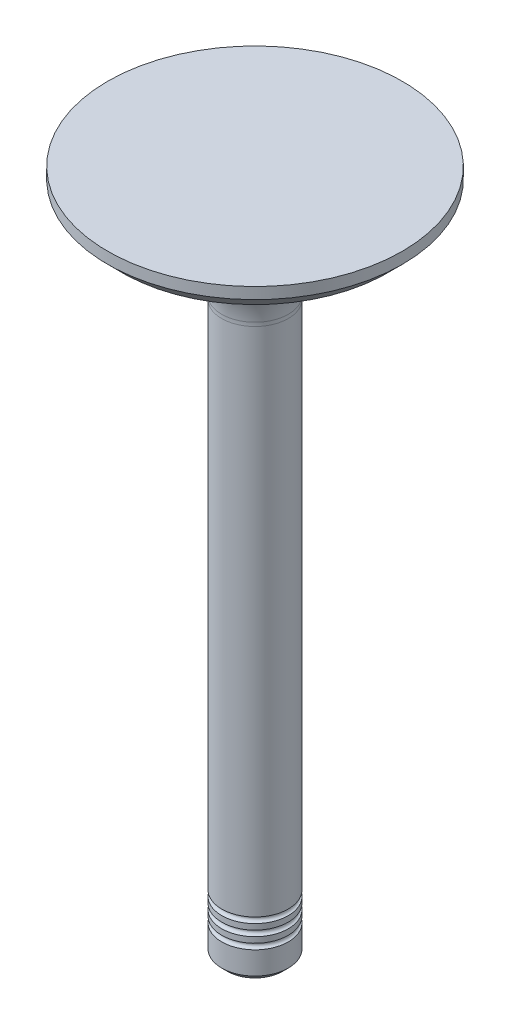
ISO-10303-21;
HEADER;
FILE_DESCRIPTION(('STEP AP214'),'2;1');
FILE_NAME('part.step','',(''),(''),'','','');
FILE_SCHEMA(('AUTOMOTIVE_DESIGN { 1 0 10303 214 1 1 1 1 }'));
ENDSEC;
DATA;
#1=APPLICATION_CONTEXT('core data for automotive mechanical design processes');
#2=APPLICATION_PROTOCOL_DEFINITION('international standard','automotive_design',2000,#1);
#3=PRODUCT_CONTEXT('',#1,'mechanical');
#4=PRODUCT('Part','Part','',(#3));
#5=PRODUCT_RELATED_PRODUCT_CATEGORY('part','',(#4));
#6=PRODUCT_DEFINITION_FORMATION('','',#4);
#7=PRODUCT_DEFINITION_CONTEXT('part definition',#1,'design');
#8=PRODUCT_DEFINITION('design','',#6,#7);
#9=PRODUCT_DEFINITION_SHAPE('','',#8);
#10=(LENGTH_UNIT() NAMED_UNIT(*) SI_UNIT(.MILLI.,.METRE.));
#11=(NAMED_UNIT(*) PLANE_ANGLE_UNIT() SI_UNIT($,.RADIAN.));
#12=(NAMED_UNIT(*) SI_UNIT($,.STERADIAN.) SOLID_ANGLE_UNIT());
#13=UNCERTAINTY_MEASURE_WITH_UNIT(LENGTH_MEASURE(1.E-05),#10,'distance_accuracy_value','');
#14=(GEOMETRIC_REPRESENTATION_CONTEXT(3) GLOBAL_UNCERTAINTY_ASSIGNED_CONTEXT((#13)) GLOBAL_UNIT_ASSIGNED_CONTEXT((#10,
#11,#12)) REPRESENTATION_CONTEXT('',''));
#15=CARTESIAN_POINT('',(0.,0.,0.));
#16=DIRECTION('',(0.,0.,1.));
#17=DIRECTION('',(1.,0.,0.));
#18=AXIS2_PLACEMENT_3D('',#15,#16,#17);
#19=CARTESIAN_POINT('',(0.,224.082988103468,0.));
#20=DIRECTION('',(0.,1.,0.));
#21=DIRECTION('',(-1.,0.,0.));
#22=AXIS2_PLACEMENT_3D('',#19,#20,#21);
#23=CYLINDRICAL_SURFACE('',#22,5.85);
#24=CARTESIAN_POINT('',(0.,113.822988103468,3.90445199648833E-13));
#25=DIRECTION('',(0.,1.,0.));
#26=DIRECTION('',(0.,0.,1.));
#27=AXIS2_PLACEMENT_3D('',#24,#25,#26);
#28=CIRCLE('',#27,5.84999999999962);
#29=CARTESIAN_POINT('',(0.,113.822988103468,5.85000000000001));
#30=VERTEX_POINT('',#29);
#31=EDGE_CURVE('E83',#30,#30,#28,.T.);
#32=ORIENTED_EDGE('',*,*,#31,.T.);
#33=EDGE_LOOP('',(#32));
#34=FACE_BOUND('',#33,.T.);
#35=CARTESIAN_POINT('',(0.,203.798278694884,0.));
#36=DIRECTION('',(0.,1.,0.));
#37=DIRECTION('',(-1.,0.,0.));
#38=AXIS2_PLACEMENT_3D('',#35,#36,#37);
#39=CIRCLE('',#38,5.85);
#40=CARTESIAN_POINT('',(-5.85,203.798278694884,0.));
#41=VERTEX_POINT('',#40);
#42=EDGE_CURVE('E59',#41,#41,#39,.F.);
#43=ORIENTED_EDGE('',*,*,#42,.T.);
#44=EDGE_LOOP('',(#43));
#45=FACE_BOUND('',#44,.T.);
#46=ADVANCED_FACE('F45',(#34,#45),#23,.T.);
#47=CARTESIAN_POINT('',(0.,203.387704382978,0.));
#48=DIRECTION('',(0.,1.,0.));
#49=DIRECTION('',(-1.,0.,0.));
#50=AXIS2_PLACEMENT_3D('',#47,#48,#49);
#51=TOROIDAL_SURFACE('',#50,21.9946855519471,16.1583871101048);
#52=CARTESIAN_POINT('',(0.,204.464969996624,0.));
#53=DIRECTION('',(0.,-1.,0.));
#54=DIRECTION('',(1.,0.,0.));
#55=AXIS2_PLACEMENT_3D('',#52,#53,#54);
#56=CIRCLE('',#55,5.87224861463346);
#57=CARTESIAN_POINT('',(5.87224861463347,204.464969996624,0.));
#58=VERTEX_POINT('',#57);
#59=EDGE_CURVE('E64',#58,#58,#56,.F.);
#60=ORIENTED_EDGE('',*,*,#59,.T.);
#61=EDGE_LOOP('',(#60));
#62=FACE_BOUND('',#61,.T.);
#63=CARTESIAN_POINT('',(0.,219.490988103468,0.));
#64=DIRECTION('',(0.,1.,0.));
#65=DIRECTION('',(-1.,0.,0.));
#66=AXIS2_PLACEMENT_3D('',#63,#64,#65);
#67=CIRCLE('',#66,23.328);
#68=CARTESIAN_POINT('',(-23.328,219.490988103468,0.));
#69=VERTEX_POINT('',#68);
#70=EDGE_CURVE('E70',#69,#69,#67,.T.);
#71=ORIENTED_EDGE('',*,*,#70,.F.);
#72=EDGE_LOOP('',(#71));
#73=FACE_BOUND('',#72,.T.);
#74=ADVANCED_FACE('F126',(#62,#73),#51,.F.);
#75=CARTESIAN_POINT('',(0.,222.082988103468,0.));
#76=DIRECTION('',(0.,1.,0.));
#77=DIRECTION('',(-1.,0.,0.));
#78=AXIS2_PLACEMENT_3D('',#75,#76,#77);
#79=CONICAL_SURFACE('',#78,25.92,0.785398163397452);
#80=ORIENTED_EDGE('',*,*,#70,.T.);
#81=EDGE_LOOP('',(#80));
#82=FACE_BOUND('',#81,.T.);
#83=CARTESIAN_POINT('',(0.,222.082988103468,0.));
#84=DIRECTION('',(0.,1.,0.));
#85=DIRECTION('',(-1.,0.,0.));
#86=AXIS2_PLACEMENT_3D('',#83,#84,#85);
#87=CIRCLE('',#86,25.92);
#88=CARTESIAN_POINT('',(-25.92,222.082988103468,0.));
#89=VERTEX_POINT('',#88);
#90=EDGE_CURVE('E74',#89,#89,#87,.T.);
#91=ORIENTED_EDGE('',*,*,#90,.F.);
#92=EDGE_LOOP('',(#91));
#93=FACE_BOUND('',#92,.T.);
#94=ADVANCED_FACE('F132',(#82,#93),#79,.T.);
#95=CARTESIAN_POINT('',(0.,224.082988103468,0.));
#96=DIRECTION('',(0.,1.,0.));
#97=DIRECTION('',(-1.,0.,0.));
#98=AXIS2_PLACEMENT_3D('',#95,#96,#97);
#99=CYLINDRICAL_SURFACE('',#98,25.92);
#100=ORIENTED_EDGE('',*,*,#90,.T.);
#101=EDGE_LOOP('',(#100));
#102=FACE_BOUND('',#101,.T.);
#103=CARTESIAN_POINT('',(0.,224.082988103468,0.));
#104=DIRECTION('',(0.,1.,0.));
#105=DIRECTION('',(-1.,0.,0.));
#106=AXIS2_PLACEMENT_3D('',#103,#104,#105);
#107=CIRCLE('',#106,25.92);
#108=CARTESIAN_POINT('',(-25.92,224.082988103468,0.));
#109=VERTEX_POINT('',#108);
#110=EDGE_CURVE('E78',#109,#109,#107,.T.);
#111=ORIENTED_EDGE('',*,*,#110,.F.);
#112=EDGE_LOOP('',(#111));
#113=FACE_BOUND('',#112,.T.);
#114=ADVANCED_FACE('F163',(#102,#113),#99,.T.);
#115=CARTESIAN_POINT('',(0.,224.082988103468,0.));
#116=DIRECTION('',(0.,1.,0.));
#117=DIRECTION('',(-1.,0.,0.));
#118=AXIS2_PLACEMENT_3D('',#115,#116,#117);
#119=PLANE('',#118);
#120=ORIENTED_EDGE('',*,*,#110,.T.);
#121=EDGE_LOOP('',(#120));
#122=FACE_BOUND('',#121,.T.);
#123=ADVANCED_FACE('F156',(#122),#119,.T.);
#124=CARTESIAN_POINT('',(0.,203.798278694884,0.));
#125=DIRECTION('',(0.,1.,0.));
#126=DIRECTION('',(-1.,0.,0.));
#127=AXIS2_PLACEMENT_3D('',#124,#125,#126);
#128=TOROIDAL_SURFACE('',#127,15.85,10.);
#129=ORIENTED_EDGE('',*,*,#42,.F.);
#130=EDGE_LOOP('',(#129));
#131=FACE_BOUND('',#130,.T.);
#132=ORIENTED_EDGE('',*,*,#59,.F.);
#133=EDGE_LOOP('',(#132));
#134=FACE_BOUND('',#133,.T.);
#135=ADVANCED_FACE('F143',(#131,#134),#128,.F.);
#136=CARTESIAN_POINT('',(0.,113.322988103468,3.88578058618805E-13));
#137=DIRECTION('',(0.,1.,0.));
#138=DIRECTION('',(0.,0.,1.));
#139=AXIS2_PLACEMENT_3D('',#136,#137,#138);
#140=TOROIDAL_SURFACE('',#139,5.84999999999962,0.5);
#141=ORIENTED_EDGE('',*,*,#31,.F.);
#142=EDGE_LOOP('',(#141));
#143=FACE_BOUND('',#142,.T.);
#144=CARTESIAN_POINT('',(0.,112.822988103468,3.87014505243645E-13));
#145=DIRECTION('',(0.,1.,0.));
#146=DIRECTION('',(0.,0.,1.));
#147=AXIS2_PLACEMENT_3D('',#144,#145,#146);
#148=CIRCLE('',#147,5.84999999999962);
#149=CARTESIAN_POINT('',(0.,112.822988103468,5.85000000000001));
#150=VERTEX_POINT('',#149);
#151=EDGE_CURVE('E88',#150,#150,#148,.T.);
#152=ORIENTED_EDGE('',*,*,#151,.T.);
#153=EDGE_LOOP('',(#152));
#154=FACE_BOUND('',#153,.T.);
#155=ADVANCED_FACE('F136',(#143,#154),#140,.F.);
#156=CARTESIAN_POINT('',(0.,111.822988103468,3.83583810838456E-13));
#157=DIRECTION('',(0.,1.,0.));
#158=DIRECTION('',(0.,0.,1.));
#159=AXIS2_PLACEMENT_3D('',#156,#157,#158);
#160=CIRCLE('',#159,5.84999999999962);
#161=CARTESIAN_POINT('',(0.,111.822988103468,5.85));
#162=VERTEX_POINT('',#161);
#163=EDGE_CURVE('E92',#162,#162,#160,.T.);
#164=ORIENTED_EDGE('',*,*,#163,.T.);
#165=EDGE_LOOP('',(#164));
#166=FACE_BOUND('',#165,.T.);
#167=ORIENTED_EDGE('',*,*,#151,.F.);
#168=EDGE_LOOP('',(#167));
#169=FACE_BOUND('',#168,.T.);
#170=ADVANCED_FACE('F124',(#166,#169),#23,.T.);
#171=CARTESIAN_POINT('',(0.,111.322988103468,3.81639164714898E-13));
#172=DIRECTION('',(0.,1.,0.));
#173=DIRECTION('',(0.,0.,1.));
#174=AXIS2_PLACEMENT_3D('',#171,#172,#173);
#175=TOROIDAL_SURFACE('',#174,5.84999999999962,0.5);
#176=ORIENTED_EDGE('',*,*,#163,.F.);
#177=EDGE_LOOP('',(#176));
#178=FACE_BOUND('',#177,.T.);
#179=CARTESIAN_POINT('',(0.,110.822988103468,3.80153116433268E-13));
#180=DIRECTION('',(0.,1.,0.));
#181=DIRECTION('',(0.,0.,1.));
#182=AXIS2_PLACEMENT_3D('',#179,#180,#181);
#183=CIRCLE('',#182,5.84999999999962);
#184=CARTESIAN_POINT('',(0.,110.822988103468,5.85));
#185=VERTEX_POINT('',#184);
#186=EDGE_CURVE('E87',#185,#185,#183,.T.);
#187=ORIENTED_EDGE('',*,*,#186,.T.);
#188=EDGE_LOOP('',(#187));
#189=FACE_BOUND('',#188,.T.);
#190=ADVANCED_FACE('F122',(#178,#189),#175,.F.);
#191=CARTESIAN_POINT('',(0.,109.822988103468,3.76722422028079E-13));
#192=DIRECTION('',(0.,1.,0.));
#193=DIRECTION('',(0.,0.,1.));
#194=AXIS2_PLACEMENT_3D('',#191,#192,#193);
#195=CIRCLE('',#194,5.84999999999962);
#196=CARTESIAN_POINT('',(0.,109.822988103468,5.85));
#197=VERTEX_POINT('',#196);
#198=EDGE_CURVE('E82',#197,#197,#195,.T.);
#199=ORIENTED_EDGE('',*,*,#198,.T.);
#200=EDGE_LOOP('',(#199));
#201=FACE_BOUND('',#200,.T.);
#202=ORIENTED_EDGE('',*,*,#186,.F.);
#203=EDGE_LOOP('',(#202));
#204=FACE_BOUND('',#203,.T.);
#205=ADVANCED_FACE('F112',(#201,#204),#23,.T.);
#206=CARTESIAN_POINT('',(0.,109.322988103468,3.7470027081099E-13));
#207=DIRECTION('',(0.,1.,0.));
#208=DIRECTION('',(0.,0.,1.));
#209=AXIS2_PLACEMENT_3D('',#206,#207,#208);
#210=TOROIDAL_SURFACE('',#209,5.84999999999962,0.5);
#211=ORIENTED_EDGE('',*,*,#198,.F.);
#212=EDGE_LOOP('',(#211));
#213=FACE_BOUND('',#212,.T.);
#214=CARTESIAN_POINT('',(0.,108.822988103468,3.73291727622891E-13));
#215=DIRECTION('',(0.,1.,0.));
#216=DIRECTION('',(0.,0.,1.));
#217=AXIS2_PLACEMENT_3D('',#214,#215,#216);
#218=CIRCLE('',#217,5.84999999999962);
#219=CARTESIAN_POINT('',(0.,108.822988103468,5.85));
#220=VERTEX_POINT('',#219);
#221=EDGE_CURVE('E96',#220,#220,#218,.T.);
#222=ORIENTED_EDGE('',*,*,#221,.T.);
#223=EDGE_LOOP('',(#222));
#224=FACE_BOUND('',#223,.T.);
#225=ADVANCED_FACE('F107',(#213,#224),#210,.F.);
#226=CARTESIAN_POINT('',(-5.84999999999998,103.822988103468,0.));
#227=DIRECTION('',(0.,-1.,0.));
#228=DIRECTION('',(1.,0.,0.));
#229=AXIS2_PLACEMENT_3D('',#226,#227,#228);
#230=PLANE('',#229);
#231=CARTESIAN_POINT('',(0.,103.822988103468,0.));
#232=DIRECTION('',(0.,-1.,0.));
#233=DIRECTION('',(1.,0.,0.));
#234=AXIS2_PLACEMENT_3D('',#231,#232,#233);
#235=CIRCLE('',#234,4.84999999999999);
#236=CARTESIAN_POINT('',(4.85000000000001,103.822988103468,0.));
#237=VERTEX_POINT('',#236);
#238=EDGE_CURVE('E10',#237,#237,#235,.T.);
#239=ORIENTED_EDGE('',*,*,#238,.T.);
#240=EDGE_LOOP('',(#239));
#241=FACE_BOUND('',#240,.T.);
#242=ADVANCED_FACE('F117',(#241),#230,.T.);
#243=CARTESIAN_POINT('',(0.,104.822988103468,0.));
#244=DIRECTION('',(0.,1.,0.));
#245=DIRECTION('',(-1.,0.,0.));
#246=AXIS2_PLACEMENT_3D('',#243,#244,#245);
#247=CONICAL_SURFACE('',#246,5.85,0.785398163397444);
#248=ORIENTED_EDGE('',*,*,#238,.F.);
#249=EDGE_LOOP('',(#248));
#250=FACE_BOUND('',#249,.T.);
#251=CARTESIAN_POINT('',(0.,104.822988103468,0.));
#252=DIRECTION('',(0.,-1.,0.));
#253=DIRECTION('',(1.,0.,0.));
#254=AXIS2_PLACEMENT_3D('',#251,#252,#253);
#255=CIRCLE('',#254,5.85);
#256=CARTESIAN_POINT('',(5.85000000000001,104.822988103468,0.));
#257=VERTEX_POINT('',#256);
#258=EDGE_CURVE('E54',#257,#257,#255,.F.);
#259=ORIENTED_EDGE('',*,*,#258,.F.);
#260=EDGE_LOOP('',(#259));
#261=FACE_BOUND('',#260,.T.);
#262=ADVANCED_FACE('F48',(#250,#261),#247,.T.);
#263=ORIENTED_EDGE('',*,*,#221,.F.);
#264=EDGE_LOOP('',(#263));
#265=FACE_BOUND('',#264,.T.);
#266=ORIENTED_EDGE('',*,*,#258,.T.);
#267=EDGE_LOOP('',(#266));
#268=FACE_BOUND('',#267,.T.);
#269=ADVANCED_FACE('F109',(#265,#268),#23,.T.);
#270=CLOSED_SHELL('',(#46,#74,#94,#114,#123,#135,#155,#170,#190,#205,#225,#242,#262,#269));
#271=MANIFOLD_SOLID_BREP('B2',#270);
#272=ADVANCED_BREP_SHAPE_REPRESENTATION('',(#18,#271),#14);
#273=SHAPE_DEFINITION_REPRESENTATION(#9,#272);
ENDSEC;
END-ISO-10303-21;
